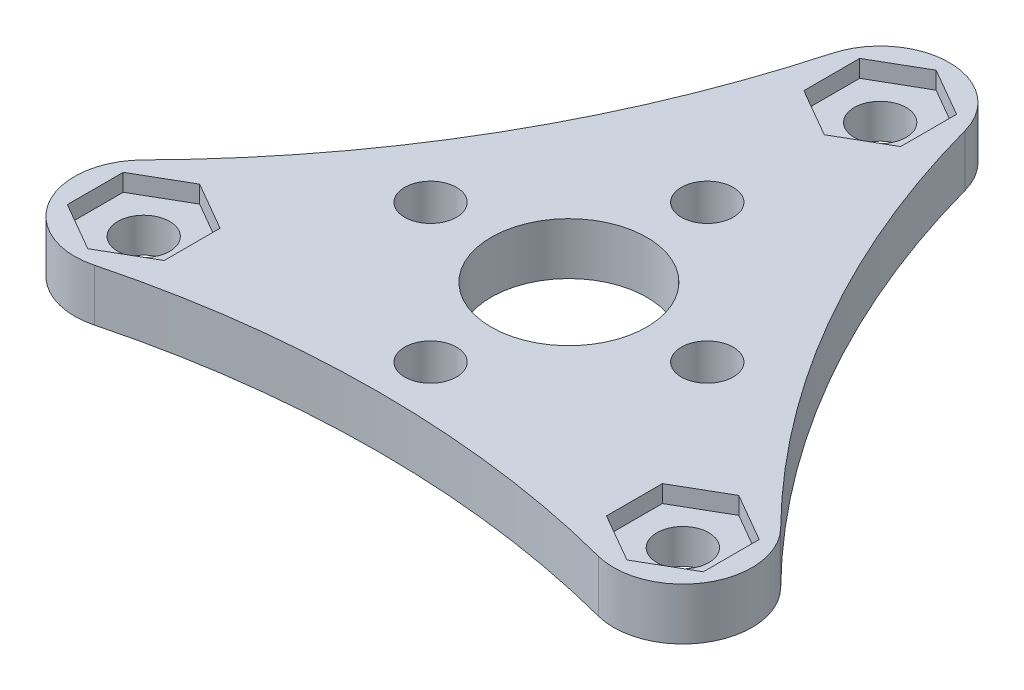
ISO-10303-21;
HEADER;
FILE_DESCRIPTION(('STEP AP214'),'2;1');
FILE_NAME('part.step','',(''),(''),'','','');
FILE_SCHEMA(('AUTOMOTIVE_DESIGN { 1 0 10303 214 1 1 1 1 }'));
ENDSEC;
DATA;
#1=APPLICATION_CONTEXT('core data for automotive mechanical design processes');
#2=APPLICATION_PROTOCOL_DEFINITION('international standard','automotive_design',2000,#1);
#3=PRODUCT_CONTEXT('',#1,'mechanical');
#4=PRODUCT('Part','Part','',(#3));
#5=PRODUCT_RELATED_PRODUCT_CATEGORY('part','',(#4));
#6=PRODUCT_DEFINITION_FORMATION('','',#4);
#7=PRODUCT_DEFINITION_CONTEXT('part definition',#1,'design');
#8=PRODUCT_DEFINITION('design','',#6,#7);
#9=PRODUCT_DEFINITION_SHAPE('','',#8);
#10=(LENGTH_UNIT() NAMED_UNIT(*) SI_UNIT(.MILLI.,.METRE.));
#11=(NAMED_UNIT(*) PLANE_ANGLE_UNIT() SI_UNIT($,.RADIAN.));
#12=(NAMED_UNIT(*) SI_UNIT($,.STERADIAN.) SOLID_ANGLE_UNIT());
#13=UNCERTAINTY_MEASURE_WITH_UNIT(LENGTH_MEASURE(1.E-05),#10,'distance_accuracy_value','');
#14=(GEOMETRIC_REPRESENTATION_CONTEXT(3) GLOBAL_UNCERTAINTY_ASSIGNED_CONTEXT((#13)) GLOBAL_UNIT_ASSIGNED_CONTEXT((#10,
#11,#12)) REPRESENTATION_CONTEXT('',''));
#15=CARTESIAN_POINT('',(0.,0.,0.));
#16=DIRECTION('',(0.,0.,1.));
#17=DIRECTION('',(1.,0.,0.));
#18=AXIS2_PLACEMENT_3D('',#15,#16,#17);
#19=CARTESIAN_POINT('',(1.52920183862257E-12,3.,-18.));
#20=DIRECTION('',(0.,-1.,0.));
#21=DIRECTION('',(0.,0.,-1.));
#22=AXIS2_PLACEMENT_3D('',#19,#20,#21);
#23=CYLINDRICAL_SURFACE('',#22,1.49999999999863);
#24=CARTESIAN_POINT('',(1.52920183862257E-12,0.,-18.));
#25=DIRECTION('',(0.,1.,0.));
#26=DIRECTION('',(0.,0.,1.));
#27=AXIS2_PLACEMENT_3D('',#24,#25,#26);
#28=CIRCLE('',#27,1.49999999999863);
#29=CARTESIAN_POINT('',(1.52920183862257E-12,0.,-16.5000000000014));
#30=VERTEX_POINT('',#29);
#31=EDGE_CURVE('E376',#30,#30,#28,.T.);
#32=ORIENTED_EDGE('',*,*,#31,.F.);
#33=EDGE_LOOP('',(#32));
#34=FACE_BOUND('',#33,.T.);
#35=CARTESIAN_POINT('',(1.52920183862257E-12,2.,-18.));
#36=DIRECTION('',(0.,1.,0.));
#37=DIRECTION('',(0.,0.,1.));
#38=AXIS2_PLACEMENT_3D('',#35,#36,#37);
#39=CIRCLE('',#38,1.49999999999863);
#40=CARTESIAN_POINT('',(1.52920183862257E-12,2.,-16.5000000000014));
#41=VERTEX_POINT('',#40);
#42=EDGE_CURVE('E40',#41,#41,#39,.T.);
#43=ORIENTED_EDGE('',*,*,#42,.T.);
#44=EDGE_LOOP('',(#43));
#45=FACE_BOUND('',#44,.T.);
#46=ADVANCED_FACE('F36',(#34,#45),#23,.F.);
#47=CARTESIAN_POINT('',(15.5884572681221,3.,9.00000000000045));
#48=DIRECTION('',(0.,-1.,0.));
#49=DIRECTION('',(0.,0.,-1.));
#50=AXIS2_PLACEMENT_3D('',#47,#48,#49);
#51=CYLINDRICAL_SURFACE('',#50,1.50000000000022);
#52=CARTESIAN_POINT('',(15.5884572681221,0.,9.00000000000045));
#53=DIRECTION('',(0.,1.,0.));
#54=DIRECTION('',(0.,0.,1.));
#55=AXIS2_PLACEMENT_3D('',#52,#53,#54);
#56=CIRCLE('',#55,1.50000000000022);
#57=CARTESIAN_POINT('',(15.5884572681221,0.,10.5000000000007));
#58=VERTEX_POINT('',#57);
#59=EDGE_CURVE('E357',#58,#58,#56,.T.);
#60=ORIENTED_EDGE('',*,*,#59,.F.);
#61=EDGE_LOOP('',(#60));
#62=FACE_BOUND('',#61,.T.);
#63=CARTESIAN_POINT('',(15.5884572681221,2.,9.00000000000045));
#64=DIRECTION('',(0.,1.,0.));
#65=DIRECTION('',(0.,0.,1.));
#66=AXIS2_PLACEMENT_3D('',#63,#64,#65);
#67=CIRCLE('',#66,1.50000000000022);
#68=CARTESIAN_POINT('',(15.5884572681221,2.,10.5000000000007));
#69=VERTEX_POINT('',#68);
#70=EDGE_CURVE('E428',#69,#69,#67,.T.);
#71=ORIENTED_EDGE('',*,*,#70,.T.);
#72=EDGE_LOOP('',(#71));
#73=FACE_BOUND('',#72,.T.);
#74=ADVANCED_FACE('F445',(#62,#73),#51,.F.);
#75=CARTESIAN_POINT('',(-15.5884572681184,3.,9.00000000000081));
#76=DIRECTION('',(0.,-1.,0.));
#77=DIRECTION('',(0.,0.,-1.));
#78=AXIS2_PLACEMENT_3D('',#75,#76,#77);
#79=CYLINDRICAL_SURFACE('',#78,1.50000000000188);
#80=CARTESIAN_POINT('',(-15.5884572681184,0.,9.00000000000081));
#81=DIRECTION('',(0.,1.,0.));
#82=DIRECTION('',(0.,0.,1.));
#83=AXIS2_PLACEMENT_3D('',#80,#81,#82);
#84=CIRCLE('',#83,1.50000000000188);
#85=CARTESIAN_POINT('',(-15.5884572681184,0.,10.5000000000027));
#86=VERTEX_POINT('',#85);
#87=EDGE_CURVE('E351',#86,#86,#84,.T.);
#88=ORIENTED_EDGE('',*,*,#87,.F.);
#89=EDGE_LOOP('',(#88));
#90=FACE_BOUND('',#89,.T.);
#91=CARTESIAN_POINT('',(-15.5884572681184,2.,9.00000000000081));
#92=DIRECTION('',(0.,1.,0.));
#93=DIRECTION('',(0.,0.,1.));
#94=AXIS2_PLACEMENT_3D('',#91,#92,#93);
#95=CIRCLE('',#94,1.50000000000188);
#96=CARTESIAN_POINT('',(-15.5884572681184,2.,10.5000000000027));
#97=VERTEX_POINT('',#96);
#98=EDGE_CURVE('E247',#97,#97,#95,.T.);
#99=ORIENTED_EDGE('',*,*,#98,.T.);
#100=EDGE_LOOP('',(#99));
#101=FACE_BOUND('',#100,.T.);
#102=ADVANCED_FACE('F451',(#90,#101),#79,.F.);
#103=CARTESIAN_POINT('',(-29.7496047149619,3.,-26.1759422904685));
#104=DIRECTION('',(0.,1.,0.));
#105=DIRECTION('',(0.,0.,1.));
#106=AXIS2_PLACEMENT_3D('',#103,#104,#105);
#107=PLANE('',#106);
#108=DIRECTION('',(0.866025403784439,0.,0.5));
#109=VECTOR('',#108,1.);
#110=CARTESIAN_POINT('',(-2.79999999999847,3.,-16.383419246269));
#111=LINE('',#110,#109);
#112=CARTESIAN_POINT('',(-2.79999999999847,3.,-16.383419246269));
#113=VERTEX_POINT('',#112);
#114=CARTESIAN_POINT('',(1.53002610581154E-12,3.,-14.7668384925381));
#115=VERTEX_POINT('',#114);
#116=EDGE_CURVE('E53',#113,#115,#111,.T.);
#117=ORIENTED_EDGE('',*,*,#116,.F.);
#118=DIRECTION('',(0.,0.,1.));
#119=VECTOR('',#118,1.);
#120=CARTESIAN_POINT('',(-2.79999999999847,3.,-19.6165807537309));
#121=LINE('',#120,#119);
#122=CARTESIAN_POINT('',(-2.79999999999847,3.,-19.6165807537309));
#123=VERTEX_POINT('',#122);
#124=EDGE_CURVE('E220',#123,#113,#121,.T.);
#125=ORIENTED_EDGE('',*,*,#124,.F.);
#126=DIRECTION('',(-0.866025403784439,0.,0.5));
#127=VECTOR('',#126,1.);
#128=CARTESIAN_POINT('',(1.53262851652121E-12,3.,-21.2331615074619));
#129=LINE('',#128,#127);
#130=CARTESIAN_POINT('',(1.53262851652121E-12,3.,-21.2331615074619));
#131=VERTEX_POINT('',#130);
#132=EDGE_CURVE('E223',#131,#123,#129,.T.);
#133=ORIENTED_EDGE('',*,*,#132,.F.);
#134=DIRECTION('',(-0.866025403784439,0.,-0.5));
#135=VECTOR('',#134,1.);
#136=CARTESIAN_POINT('',(2.80000000000153,3.,-19.6165807537309));
#137=LINE('',#136,#135);
#138=CARTESIAN_POINT('',(2.80000000000153,3.,-19.6165807537309));
#139=VERTEX_POINT('',#138);
#140=EDGE_CURVE('E240',#139,#131,#137,.T.);
#141=ORIENTED_EDGE('',*,*,#140,.F.);
#142=DIRECTION('',(0.,0.,-1.));
#143=VECTOR('',#142,1.);
#144=CARTESIAN_POINT('',(2.80000000000153,3.,-16.383419246269));
#145=LINE('',#144,#143);
#146=CARTESIAN_POINT('',(2.80000000000153,3.,-16.383419246269));
#147=VERTEX_POINT('',#146);
#148=EDGE_CURVE('E237',#147,#139,#145,.T.);
#149=ORIENTED_EDGE('',*,*,#148,.F.);
#150=DIRECTION('',(0.866025403784439,0.,-0.5));
#151=VECTOR('',#150,1.);
#152=CARTESIAN_POINT('',(1.52915761052985E-12,3.,-14.7668384925381));
#153=LINE('',#152,#151);
#154=EDGE_CURVE('E234',#115,#147,#153,.T.);
#155=ORIENTED_EDGE('',*,*,#154,.F.);
#156=EDGE_LOOP('',(#117,#125,#133,#141,#149,#155));
#157=FACE_BOUND('',#156,.T.);
#158=DIRECTION('',(-0.866025403784439,0.,0.5));
#159=VECTOR('',#158,1.);
#160=CARTESIAN_POINT('',(15.5884572681201,3.,5.76683849253888));
#161=LINE('',#160,#159);
#162=CARTESIAN_POINT('',(15.5884572681201,3.,5.76683849253888));
#163=VERTEX_POINT('',#162);
#164=CARTESIAN_POINT('',(12.7884572681201,3.,7.38341924626983));
#165=VERTEX_POINT('',#164);
#166=EDGE_CURVE('E61',#163,#165,#161,.T.);
#167=ORIENTED_EDGE('',*,*,#166,.F.);
#168=DIRECTION('',(-0.866025403784439,0.,-0.5));
#169=VECTOR('',#168,1.);
#170=CARTESIAN_POINT('',(18.3884572681201,3.,7.38341924626983));
#171=LINE('',#170,#169);
#172=CARTESIAN_POINT('',(18.3884572681201,3.,7.38341924626983));
#173=VERTEX_POINT('',#172);
#174=EDGE_CURVE('E259',#173,#163,#171,.T.);
#175=ORIENTED_EDGE('',*,*,#174,.F.);
#176=DIRECTION('',(0.,0.,-1.));
#177=VECTOR('',#176,1.);
#178=CARTESIAN_POINT('',(18.3884572681201,3.,10.6165807537317));
#179=LINE('',#178,#177);
#180=CARTESIAN_POINT('',(18.3884572681201,3.,10.6165807537317));
#181=VERTEX_POINT('',#180);
#182=EDGE_CURVE('E286',#181,#173,#179,.T.);
#183=ORIENTED_EDGE('',*,*,#182,.F.);
#184=DIRECTION('',(0.866025403784438,0.,-0.5));
#185=VECTOR('',#184,1.);
#186=CARTESIAN_POINT('',(15.5884572681201,3.,12.2331615074627));
#187=LINE('',#186,#185);
#188=CARTESIAN_POINT('',(15.5884572681201,3.,12.2331615074627));
#189=VERTEX_POINT('',#188);
#190=EDGE_CURVE('E283',#189,#181,#187,.T.);
#191=ORIENTED_EDGE('',*,*,#190,.F.);
#192=DIRECTION('',(0.866025403784439,0.,0.5));
#193=VECTOR('',#192,1.);
#194=CARTESIAN_POINT('',(12.7884572681201,3.,10.6165807537317));
#195=LINE('',#194,#193);
#196=CARTESIAN_POINT('',(12.7884572681201,3.,10.6165807537317));
#197=VERTEX_POINT('',#196);
#198=EDGE_CURVE('E280',#197,#189,#195,.T.);
#199=ORIENTED_EDGE('',*,*,#198,.F.);
#200=DIRECTION('',(0.,0.,1.));
#201=VECTOR('',#200,1.);
#202=CARTESIAN_POINT('',(12.7884572681201,3.,7.38341924626983));
#203=LINE('',#202,#201);
#204=EDGE_CURVE('E276',#165,#197,#203,.T.);
#205=ORIENTED_EDGE('',*,*,#204,.F.);
#206=EDGE_LOOP('',(#167,#175,#183,#191,#199,#205));
#207=FACE_BOUND('',#206,.T.);
#208=DIRECTION('',(0.,0.,-1.));
#209=VECTOR('',#208,1.);
#210=CARTESIAN_POINT('',(-12.7884572681197,3.,10.6165807537302));
#211=LINE('',#210,#209);
#212=CARTESIAN_POINT('',(-12.7884572681197,3.,10.6165807537302));
#213=VERTEX_POINT('',#212);
#214=CARTESIAN_POINT('',(-12.7884572681197,3.,7.38341924626827));
#215=VERTEX_POINT('',#214);
#216=EDGE_CURVE('E321',#213,#215,#211,.T.);
#217=ORIENTED_EDGE('',*,*,#216,.F.);
#218=DIRECTION('',(0.866025403784438,0.,-0.5));
#219=VECTOR('',#218,1.);
#220=CARTESIAN_POINT('',(-15.5884572681197,3.,12.2331615074611));
#221=LINE('',#220,#219);
#222=CARTESIAN_POINT('',(-15.5884572681197,3.,12.2331615074611));
#223=VERTEX_POINT('',#222);
#224=EDGE_CURVE('E305',#223,#213,#221,.T.);
#225=ORIENTED_EDGE('',*,*,#224,.F.);
#226=DIRECTION('',(0.866025403784439,0.,0.499999999999999));
#227=VECTOR('',#226,1.);
#228=CARTESIAN_POINT('',(-18.3884572681197,3.,10.6165807537302));
#229=LINE('',#228,#227);
#230=CARTESIAN_POINT('',(-18.3884572681197,3.,10.6165807537302));
#231=VERTEX_POINT('',#230);
#232=EDGE_CURVE('E332',#231,#223,#229,.T.);
#233=ORIENTED_EDGE('',*,*,#232,.F.);
#234=DIRECTION('',(0.,0.,1.));
#235=VECTOR('',#234,1.);
#236=CARTESIAN_POINT('',(-18.3884572681197,3.,7.38341924626827));
#237=LINE('',#236,#235);
#238=CARTESIAN_POINT('',(-18.3884572681197,3.,7.38341924626827));
#239=VERTEX_POINT('',#238);
#240=EDGE_CURVE('E329',#239,#231,#237,.T.);
#241=ORIENTED_EDGE('',*,*,#240,.F.);
#242=DIRECTION('',(-0.866025403784438,0.,0.5));
#243=VECTOR('',#242,1.);
#244=CARTESIAN_POINT('',(-15.5884572681197,3.,5.76683849253731));
#245=LINE('',#244,#243);
#246=CARTESIAN_POINT('',(-15.5884572681197,3.,5.76683849253731));
#247=VERTEX_POINT('',#246);
#248=EDGE_CURVE('E326',#247,#239,#245,.T.);
#249=ORIENTED_EDGE('',*,*,#248,.F.);
#250=DIRECTION('',(-0.866025403784439,0.,-0.5));
#251=VECTOR('',#250,1.);
#252=CARTESIAN_POINT('',(-12.7884572681197,3.,7.38341924626827));
#253=LINE('',#252,#251);
#254=EDGE_CURVE('E323',#215,#247,#253,.T.);
#255=ORIENTED_EDGE('',*,*,#254,.F.);
#256=EDGE_LOOP('',(#217,#225,#233,#241,#249,#255));
#257=FACE_BOUND('',#256,.T.);
#258=CARTESIAN_POINT('',(0.,3.,-8.));
#259=DIRECTION('',(0.,1.,0.));
#260=DIRECTION('',(0.,0.,1.));
#261=AXIS2_PLACEMENT_3D('',#258,#259,#260);
#262=CIRCLE('',#261,1.5);
#263=CARTESIAN_POINT('',(0.,3.,-6.5));
#264=VERTEX_POINT('',#263);
#265=EDGE_CURVE('E361',#264,#264,#262,.T.);
#266=ORIENTED_EDGE('',*,*,#265,.F.);
#267=EDGE_LOOP('',(#266));
#268=FACE_BOUND('',#267,.T.);
#269=CARTESIAN_POINT('',(0.,3.,8.));
#270=DIRECTION('',(0.,1.,0.));
#271=DIRECTION('',(0.,0.,1.));
#272=AXIS2_PLACEMENT_3D('',#269,#270,#271);
#273=CIRCLE('',#272,1.5);
#274=CARTESIAN_POINT('',(0.,3.,9.5));
#275=VERTEX_POINT('',#274);
#276=EDGE_CURVE('E373',#275,#275,#273,.T.);
#277=ORIENTED_EDGE('',*,*,#276,.F.);
#278=EDGE_LOOP('',(#277));
#279=FACE_BOUND('',#278,.T.);
#280=CARTESIAN_POINT('',(8.,3.,0.));
#281=DIRECTION('',(0.,1.,0.));
#282=DIRECTION('',(0.,0.,1.));
#283=AXIS2_PLACEMENT_3D('',#280,#281,#282);
#284=CIRCLE('',#283,1.5);
#285=CARTESIAN_POINT('',(8.,3.,1.5));
#286=VERTEX_POINT('',#285);
#287=EDGE_CURVE('E382',#286,#286,#284,.T.);
#288=ORIENTED_EDGE('',*,*,#287,.F.);
#289=EDGE_LOOP('',(#288));
#290=FACE_BOUND('',#289,.T.);
#291=CARTESIAN_POINT('',(-59.4992094299253,3.,-34.351884580937));
#292=DIRECTION('',(0.,-1.,0.));
#293=DIRECTION('',(0.,0.,1.));
#294=AXIS2_PLACEMENT_3D('',#291,#292,#293);
#295=CIRCLE('',#294,57.7052676206382);
#296=CARTESIAN_POINT('',(-3.85699384990613,3.,-19.0599992649877));
#297=VERTEX_POINT('',#296);
#298=CARTESIAN_POINT('',(-18.4349404845424,3.,6.18974497623219));
#299=VERTEX_POINT('',#298);
#300=EDGE_CURVE('E388',#297,#299,#295,.T.);
#301=ORIENTED_EDGE('',*,*,#300,.T.);
#302=CARTESIAN_POINT('',(-15.5884572681184,3.,9.00000000000081));
#303=DIRECTION('',(0.,1.,0.));
#304=DIRECTION('',(0.,0.,1.));
#305=AXIS2_PLACEMENT_3D('',#302,#303,#304);
#306=CIRCLE('',#305,4.00000000000001);
#307=CARTESIAN_POINT('',(-14.5779466346368,3.,12.8702542887551));
#308=VERTEX_POINT('',#307);
#309=EDGE_CURVE('E391',#299,#308,#306,.T.);
#310=ORIENTED_EDGE('',*,*,#309,.T.);
#311=CARTESIAN_POINT('',(2.54741645301558E-12,3.,68.7037691618766));
#312=DIRECTION('',(0.,-1.,0.));
#313=DIRECTION('',(0.,0.,1.));
#314=AXIS2_PLACEMENT_3D('',#311,#312,#313);
#315=CIRCLE('',#314,57.7052676206382);
#316=CARTESIAN_POINT('',(14.5779466346376,3.,12.8702542887539));
#317=VERTEX_POINT('',#316);
#318=EDGE_CURVE('E394',#308,#317,#315,.T.);
#319=ORIENTED_EDGE('',*,*,#318,.T.);
#320=CARTESIAN_POINT('',(15.5884572681221,3.,9.00000000000045));
#321=DIRECTION('',(0.,1.,0.));
#322=DIRECTION('',(0.,0.,1.));
#323=AXIS2_PLACEMENT_3D('',#320,#321,#322);
#324=CIRCLE('',#323,4.);
#325=CARTESIAN_POINT('',(18.4349404845481,3.,6.18974497623392));
#326=VERTEX_POINT('',#325);
#327=EDGE_CURVE('E396',#317,#326,#324,.T.);
#328=ORIENTED_EDGE('',*,*,#327,.T.);
#329=CARTESIAN_POINT('',(59.499209429928,3.,-34.3518845809384));
#330=DIRECTION('',(0.,-1.,0.));
#331=DIRECTION('',(0.,0.,1.));
#332=AXIS2_PLACEMENT_3D('',#329,#330,#331);
#333=CIRCLE('',#332,57.7052676206382);
#334=CARTESIAN_POINT('',(3.85699384990997,3.,-19.0599992649849));
#335=VERTEX_POINT('',#334);
#336=EDGE_CURVE('E398',#326,#335,#333,.T.);
#337=ORIENTED_EDGE('',*,*,#336,.T.);
#338=CARTESIAN_POINT('',(1.52920183862257E-12,3.,-18.));
#339=DIRECTION('',(0.,1.,0.));
#340=DIRECTION('',(0.,0.,1.));
#341=AXIS2_PLACEMENT_3D('',#338,#339,#340);
#342=CIRCLE('',#341,4.);
#343=EDGE_CURVE('E400',#335,#297,#342,.T.);
#344=ORIENTED_EDGE('',*,*,#343,.T.);
#345=EDGE_LOOP('',(#301,#310,#319,#328,#337,#344));
#346=FACE_BOUND('',#345,.T.);
#347=CARTESIAN_POINT('',(-8.,3.,0.));
#348=DIRECTION('',(0.,1.,0.));
#349=DIRECTION('',(0.,0.,1.));
#350=AXIS2_PLACEMENT_3D('',#347,#348,#349);
#351=CIRCLE('',#350,1.5);
#352=CARTESIAN_POINT('',(-8.,3.,1.49999999999994));
#353=VERTEX_POINT('',#352);
#354=EDGE_CURVE('E367',#353,#353,#351,.T.);
#355=ORIENTED_EDGE('',*,*,#354,.F.);
#356=EDGE_LOOP('',(#355));
#357=FACE_BOUND('',#356,.T.);
#358=CARTESIAN_POINT('',(0.,3.,0.));
#359=DIRECTION('',(0.,1.,0.));
#360=DIRECTION('',(0.,0.,1.));
#361=AXIS2_PLACEMENT_3D('',#358,#359,#360);
#362=CIRCLE('',#361,4.5);
#363=CARTESIAN_POINT('',(0.,3.,4.5));
#364=VERTEX_POINT('',#363);
#365=EDGE_CURVE('E348',#364,#364,#362,.T.);
#366=ORIENTED_EDGE('',*,*,#365,.F.);
#367=EDGE_LOOP('',(#366));
#368=FACE_BOUND('',#367,.T.);
#369=ADVANCED_FACE('F464',(#157,#207,#257,#268,#279,#290,#346,#357,#368),#107,.T.);
#370=CARTESIAN_POINT('',(-29.7496047149619,0.,-26.1759422904685));
#371=DIRECTION('',(0.,1.,0.));
#372=DIRECTION('',(0.,0.,1.));
#373=AXIS2_PLACEMENT_3D('',#370,#371,#372);
#374=PLANE('',#373);
#375=CARTESIAN_POINT('',(-59.4992094299253,0.,-34.351884580937));
#376=DIRECTION('',(0.,-1.,0.));
#377=DIRECTION('',(0.,0.,1.));
#378=AXIS2_PLACEMENT_3D('',#375,#376,#377);
#379=CIRCLE('',#378,57.7052676206382);
#380=CARTESIAN_POINT('',(-3.85699384990613,0.,-19.0599992649877));
#381=VERTEX_POINT('',#380);
#382=CARTESIAN_POINT('',(-18.4349404845424,0.,6.18974497623219));
#383=VERTEX_POINT('',#382);
#384=EDGE_CURVE('E385',#381,#383,#379,.T.);
#385=ORIENTED_EDGE('',*,*,#384,.F.);
#386=CARTESIAN_POINT('',(1.52920183862257E-12,0.,-18.));
#387=DIRECTION('',(0.,1.,0.));
#388=DIRECTION('',(0.,0.,1.));
#389=AXIS2_PLACEMENT_3D('',#386,#387,#388);
#390=CIRCLE('',#389,4.);
#391=CARTESIAN_POINT('',(3.85699384990997,0.,-19.0599992649849));
#392=VERTEX_POINT('',#391);
#393=EDGE_CURVE('E392',#392,#381,#390,.T.);
#394=ORIENTED_EDGE('',*,*,#393,.F.);
#395=CARTESIAN_POINT('',(59.499209429928,0.,-34.3518845809384));
#396=DIRECTION('',(0.,-1.,0.));
#397=DIRECTION('',(0.,0.,1.));
#398=AXIS2_PLACEMENT_3D('',#395,#396,#397);
#399=CIRCLE('',#398,57.7052676206382);
#400=CARTESIAN_POINT('',(18.4349404845481,0.,6.18974497623392));
#401=VERTEX_POINT('',#400);
#402=EDGE_CURVE('E411',#401,#392,#399,.T.);
#403=ORIENTED_EDGE('',*,*,#402,.F.);
#404=CARTESIAN_POINT('',(15.5884572681221,0.,9.00000000000045));
#405=DIRECTION('',(0.,1.,0.));
#406=DIRECTION('',(0.,0.,1.));
#407=AXIS2_PLACEMENT_3D('',#404,#405,#406);
#408=CIRCLE('',#407,4.);
#409=CARTESIAN_POINT('',(14.5779466346376,0.,12.8702542887539));
#410=VERTEX_POINT('',#409);
#411=EDGE_CURVE('E409',#410,#401,#408,.T.);
#412=ORIENTED_EDGE('',*,*,#411,.F.);
#413=CARTESIAN_POINT('',(2.54741645301558E-12,0.,68.7037691618766));
#414=DIRECTION('',(0.,-1.,0.));
#415=DIRECTION('',(0.,0.,1.));
#416=AXIS2_PLACEMENT_3D('',#413,#414,#415);
#417=CIRCLE('',#416,57.7052676206382);
#418=CARTESIAN_POINT('',(-14.5779466346368,0.,12.8702542887551));
#419=VERTEX_POINT('',#418);
#420=EDGE_CURVE('E407',#419,#410,#417,.T.);
#421=ORIENTED_EDGE('',*,*,#420,.F.);
#422=CARTESIAN_POINT('',(-15.5884572681184,0.,9.00000000000081));
#423=DIRECTION('',(0.,1.,0.));
#424=DIRECTION('',(0.,0.,1.));
#425=AXIS2_PLACEMENT_3D('',#422,#423,#424);
#426=CIRCLE('',#425,4.00000000000001);
#427=EDGE_CURVE('E405',#383,#419,#426,.T.);
#428=ORIENTED_EDGE('',*,*,#427,.F.);
#429=EDGE_LOOP('',(#385,#394,#403,#412,#421,#428));
#430=FACE_BOUND('',#429,.T.);
#431=CARTESIAN_POINT('',(8.,0.,0.));
#432=DIRECTION('',(0.,1.,0.));
#433=DIRECTION('',(0.,0.,1.));
#434=AXIS2_PLACEMENT_3D('',#431,#432,#433);
#435=CIRCLE('',#434,1.5);
#436=CARTESIAN_POINT('',(8.,0.,1.5));
#437=VERTEX_POINT('',#436);
#438=EDGE_CURVE('E381',#437,#437,#435,.T.);
#439=ORIENTED_EDGE('',*,*,#438,.T.);
#440=EDGE_LOOP('',(#439));
#441=FACE_BOUND('',#440,.T.);
#442=ORIENTED_EDGE('',*,*,#31,.T.);
#443=EDGE_LOOP('',(#442));
#444=FACE_BOUND('',#443,.T.);
#445=CARTESIAN_POINT('',(0.,0.,8.));
#446=DIRECTION('',(0.,1.,0.));
#447=DIRECTION('',(0.,0.,1.));
#448=AXIS2_PLACEMENT_3D('',#445,#446,#447);
#449=CIRCLE('',#448,1.5);
#450=CARTESIAN_POINT('',(0.,0.,9.5));
#451=VERTEX_POINT('',#450);
#452=EDGE_CURVE('E370',#451,#451,#449,.T.);
#453=ORIENTED_EDGE('',*,*,#452,.T.);
#454=EDGE_LOOP('',(#453));
#455=FACE_BOUND('',#454,.T.);
#456=CARTESIAN_POINT('',(-8.,0.,0.));
#457=DIRECTION('',(0.,1.,0.));
#458=DIRECTION('',(0.,0.,1.));
#459=AXIS2_PLACEMENT_3D('',#456,#457,#458);
#460=CIRCLE('',#459,1.5);
#461=CARTESIAN_POINT('',(-8.,0.,1.49999999999994));
#462=VERTEX_POINT('',#461);
#463=EDGE_CURVE('E364',#462,#462,#460,.T.);
#464=ORIENTED_EDGE('',*,*,#463,.T.);
#465=EDGE_LOOP('',(#464));
#466=FACE_BOUND('',#465,.T.);
#467=CARTESIAN_POINT('',(0.,0.,-8.));
#468=DIRECTION('',(0.,1.,0.));
#469=DIRECTION('',(0.,0.,1.));
#470=AXIS2_PLACEMENT_3D('',#467,#468,#469);
#471=CIRCLE('',#470,1.5);
#472=CARTESIAN_POINT('',(0.,0.,-6.5));
#473=VERTEX_POINT('',#472);
#474=EDGE_CURVE('E360',#473,#473,#471,.T.);
#475=ORIENTED_EDGE('',*,*,#474,.T.);
#476=EDGE_LOOP('',(#475));
#477=FACE_BOUND('',#476,.T.);
#478=ORIENTED_EDGE('',*,*,#59,.T.);
#479=EDGE_LOOP('',(#478));
#480=FACE_BOUND('',#479,.T.);
#481=ORIENTED_EDGE('',*,*,#87,.T.);
#482=EDGE_LOOP('',(#481));
#483=FACE_BOUND('',#482,.T.);
#484=CARTESIAN_POINT('',(0.,0.,0.));
#485=DIRECTION('',(0.,1.,0.));
#486=DIRECTION('',(0.,0.,1.));
#487=AXIS2_PLACEMENT_3D('',#484,#485,#486);
#488=CIRCLE('',#487,4.5);
#489=CARTESIAN_POINT('',(0.,0.,4.5));
#490=VERTEX_POINT('',#489);
#491=EDGE_CURVE('E352',#490,#490,#488,.T.);
#492=ORIENTED_EDGE('',*,*,#491,.T.);
#493=EDGE_LOOP('',(#492));
#494=FACE_BOUND('',#493,.T.);
#495=ADVANCED_FACE('F467',(#430,#441,#444,#455,#466,#477,#480,#483,#494),#374,.F.);
#496=CARTESIAN_POINT('',(-59.4992094299253,3.,-34.351884580937));
#497=DIRECTION('',(0.,-1.,0.));
#498=DIRECTION('',(0.,0.,-1.));
#499=AXIS2_PLACEMENT_3D('',#496,#497,#498);
#500=CYLINDRICAL_SURFACE('',#499,57.7052676206382);
#501=ORIENTED_EDGE('',*,*,#384,.T.);
#502=DIRECTION('',(0.,-1.,0.));
#503=VECTOR('',#502,1.);
#504=CARTESIAN_POINT('',(-18.4349404845424,3.,6.18974497623219));
#505=LINE('',#504,#503);
#506=EDGE_CURVE('E11',#299,#383,#505,.T.);
#507=ORIENTED_EDGE('',*,*,#506,.F.);
#508=ORIENTED_EDGE('',*,*,#300,.F.);
#509=DIRECTION('',(0.,-1.,0.));
#510=VECTOR('',#509,1.);
#511=CARTESIAN_POINT('',(-3.85699384990613,3.,-19.0599992649877));
#512=LINE('',#511,#510);
#513=EDGE_CURVE('E402',#297,#381,#512,.T.);
#514=ORIENTED_EDGE('',*,*,#513,.T.);
#515=EDGE_LOOP('',(#501,#507,#508,#514));
#516=FACE_BOUND('',#515,.T.);
#517=ADVANCED_FACE('F38',(#516),#500,.F.);
#518=CARTESIAN_POINT('',(-15.5884572681184,3.,9.00000000000081));
#519=DIRECTION('',(0.,-1.,0.));
#520=DIRECTION('',(0.,0.,-1.));
#521=AXIS2_PLACEMENT_3D('',#518,#519,#520);
#522=CYLINDRICAL_SURFACE('',#521,4.00000000000001);
#523=ORIENTED_EDGE('',*,*,#427,.T.);
#524=DIRECTION('',(0.,-1.,0.));
#525=VECTOR('',#524,1.);
#526=CARTESIAN_POINT('',(-14.5779466346368,3.,12.8702542887551));
#527=LINE('',#526,#525);
#528=EDGE_CURVE('E45',#308,#419,#527,.T.);
#529=ORIENTED_EDGE('',*,*,#528,.F.);
#530=ORIENTED_EDGE('',*,*,#309,.F.);
#531=ORIENTED_EDGE('',*,*,#506,.T.);
#532=EDGE_LOOP('',(#523,#529,#530,#531));
#533=FACE_BOUND('',#532,.T.);
#534=ADVANCED_FACE('F485',(#533),#522,.T.);
#535=CARTESIAN_POINT('',(2.54741645301558E-12,3.,68.7037691618766));
#536=DIRECTION('',(0.,-1.,0.));
#537=DIRECTION('',(0.,0.,-1.));
#538=AXIS2_PLACEMENT_3D('',#535,#536,#537);
#539=CYLINDRICAL_SURFACE('',#538,57.7052676206382);
#540=ORIENTED_EDGE('',*,*,#420,.T.);
#541=DIRECTION('',(0.,-1.,0.));
#542=VECTOR('',#541,1.);
#543=CARTESIAN_POINT('',(14.5779466346376,3.,12.8702542887539));
#544=LINE('',#543,#542);
#545=EDGE_CURVE('E422',#317,#410,#544,.T.);
#546=ORIENTED_EDGE('',*,*,#545,.F.);
#547=ORIENTED_EDGE('',*,*,#318,.F.);
#548=ORIENTED_EDGE('',*,*,#528,.T.);
#549=EDGE_LOOP('',(#540,#546,#547,#548));
#550=FACE_BOUND('',#549,.T.);
#551=ADVANCED_FACE('F482',(#550),#539,.F.);
#552=CARTESIAN_POINT('',(15.5884572681221,3.,9.00000000000045));
#553=DIRECTION('',(0.,-1.,0.));
#554=DIRECTION('',(0.,0.,-1.));
#555=AXIS2_PLACEMENT_3D('',#552,#553,#554);
#556=CYLINDRICAL_SURFACE('',#555,4.);
#557=ORIENTED_EDGE('',*,*,#411,.T.);
#558=DIRECTION('',(0.,-1.,0.));
#559=VECTOR('',#558,1.);
#560=CARTESIAN_POINT('',(18.4349404845481,3.,6.18974497623392));
#561=LINE('',#560,#559);
#562=EDGE_CURVE('E419',#326,#401,#561,.T.);
#563=ORIENTED_EDGE('',*,*,#562,.F.);
#564=ORIENTED_EDGE('',*,*,#327,.F.);
#565=ORIENTED_EDGE('',*,*,#545,.T.);
#566=EDGE_LOOP('',(#557,#563,#564,#565));
#567=FACE_BOUND('',#566,.T.);
#568=ADVANCED_FACE('F478',(#567),#556,.T.);
#569=CARTESIAN_POINT('',(59.499209429928,3.,-34.3518845809384));
#570=DIRECTION('',(0.,-1.,0.));
#571=DIRECTION('',(0.,0.,-1.));
#572=AXIS2_PLACEMENT_3D('',#569,#570,#571);
#573=CYLINDRICAL_SURFACE('',#572,57.7052676206382);
#574=ORIENTED_EDGE('',*,*,#402,.T.);
#575=DIRECTION('',(0.,-1.,0.));
#576=VECTOR('',#575,1.);
#577=CARTESIAN_POINT('',(3.85699384990997,3.,-19.0599992649849));
#578=LINE('',#577,#576);
#579=EDGE_CURVE('E416',#335,#392,#578,.T.);
#580=ORIENTED_EDGE('',*,*,#579,.F.);
#581=ORIENTED_EDGE('',*,*,#336,.F.);
#582=ORIENTED_EDGE('',*,*,#562,.T.);
#583=EDGE_LOOP('',(#574,#580,#581,#582));
#584=FACE_BOUND('',#583,.T.);
#585=ADVANCED_FACE('F474',(#584),#573,.F.);
#586=CARTESIAN_POINT('',(1.52920183862257E-12,3.,-18.));
#587=DIRECTION('',(0.,-1.,0.));
#588=DIRECTION('',(0.,0.,-1.));
#589=AXIS2_PLACEMENT_3D('',#586,#587,#588);
#590=CYLINDRICAL_SURFACE('',#589,4.);
#591=ORIENTED_EDGE('',*,*,#393,.T.);
#592=ORIENTED_EDGE('',*,*,#513,.F.);
#593=ORIENTED_EDGE('',*,*,#343,.F.);
#594=ORIENTED_EDGE('',*,*,#579,.T.);
#595=EDGE_LOOP('',(#591,#592,#593,#594));
#596=FACE_BOUND('',#595,.T.);
#597=ADVANCED_FACE('F462',(#596),#590,.T.);
#598=CARTESIAN_POINT('',(8.,3.,0.));
#599=DIRECTION('',(0.,-1.,0.));
#600=DIRECTION('',(0.,0.,-1.));
#601=AXIS2_PLACEMENT_3D('',#598,#599,#600);
#602=CYLINDRICAL_SURFACE('',#601,1.5);
#603=ORIENTED_EDGE('',*,*,#287,.T.);
#604=EDGE_LOOP('',(#603));
#605=FACE_BOUND('',#604,.T.);
#606=ORIENTED_EDGE('',*,*,#438,.F.);
#607=EDGE_LOOP('',(#606));
#608=FACE_BOUND('',#607,.T.);
#609=ADVANCED_FACE('F459',(#605,#608),#602,.F.);
#610=CARTESIAN_POINT('',(0.,3.,8.));
#611=DIRECTION('',(0.,-1.,0.));
#612=DIRECTION('',(0.,0.,-1.));
#613=AXIS2_PLACEMENT_3D('',#610,#611,#612);
#614=CYLINDRICAL_SURFACE('',#613,1.5);
#615=ORIENTED_EDGE('',*,*,#276,.T.);
#616=EDGE_LOOP('',(#615));
#617=FACE_BOUND('',#616,.T.);
#618=ORIENTED_EDGE('',*,*,#452,.F.);
#619=EDGE_LOOP('',(#618));
#620=FACE_BOUND('',#619,.T.);
#621=ADVANCED_FACE('F457',(#617,#620),#614,.F.);
#622=CARTESIAN_POINT('',(-8.,3.,0.));
#623=DIRECTION('',(0.,-1.,0.));
#624=DIRECTION('',(0.,0.,-1.));
#625=AXIS2_PLACEMENT_3D('',#622,#623,#624);
#626=CYLINDRICAL_SURFACE('',#625,1.5);
#627=ORIENTED_EDGE('',*,*,#354,.T.);
#628=EDGE_LOOP('',(#627));
#629=FACE_BOUND('',#628,.T.);
#630=ORIENTED_EDGE('',*,*,#463,.F.);
#631=EDGE_LOOP('',(#630));
#632=FACE_BOUND('',#631,.T.);
#633=ADVANCED_FACE('F531',(#629,#632),#626,.F.);
#634=CARTESIAN_POINT('',(0.,3.,-8.));
#635=DIRECTION('',(0.,-1.,0.));
#636=DIRECTION('',(0.,0.,-1.));
#637=AXIS2_PLACEMENT_3D('',#634,#635,#636);
#638=CYLINDRICAL_SURFACE('',#637,1.5);
#639=ORIENTED_EDGE('',*,*,#265,.T.);
#640=EDGE_LOOP('',(#639));
#641=FACE_BOUND('',#640,.T.);
#642=ORIENTED_EDGE('',*,*,#474,.F.);
#643=EDGE_LOOP('',(#642));
#644=FACE_BOUND('',#643,.T.);
#645=ADVANCED_FACE('F520',(#641,#644),#638,.F.);
#646=CARTESIAN_POINT('',(0.,3.,0.));
#647=DIRECTION('',(0.,-1.,0.));
#648=DIRECTION('',(0.,0.,-1.));
#649=AXIS2_PLACEMENT_3D('',#646,#647,#648);
#650=CYLINDRICAL_SURFACE('',#649,4.5);
#651=ORIENTED_EDGE('',*,*,#365,.T.);
#652=EDGE_LOOP('',(#651));
#653=FACE_BOUND('',#652,.T.);
#654=ORIENTED_EDGE('',*,*,#491,.F.);
#655=EDGE_LOOP('',(#654));
#656=FACE_BOUND('',#655,.T.);
#657=ADVANCED_FACE('F516',(#653,#656),#650,.F.);
#658=CARTESIAN_POINT('',(-12.7884572681197,2.,10.6165807537302));
#659=DIRECTION('',(1.,0.,0.));
#660=DIRECTION('',(0.,0.,-1.));
#661=AXIS2_PLACEMENT_3D('',#658,#659,#660);
#662=PLANE('',#661);
#663=ORIENTED_EDGE('',*,*,#216,.T.);
#664=DIRECTION('',(0.,1.,0.));
#665=VECTOR('',#664,1.);
#666=CARTESIAN_POINT('',(-12.7884572681197,2.,7.38341924626827));
#667=LINE('',#666,#665);
#668=CARTESIAN_POINT('',(-12.7884572681197,2.,7.38341924626827));
#669=VERTEX_POINT('',#668);
#670=EDGE_CURVE('E320',#669,#215,#667,.T.);
#671=ORIENTED_EDGE('',*,*,#670,.F.);
#672=DIRECTION('',(0.,0.,-1.));
#673=VECTOR('',#672,1.);
#674=CARTESIAN_POINT('',(-12.7884572681197,2.,10.6165807537302));
#675=LINE('',#674,#673);
#676=CARTESIAN_POINT('',(-12.7884572681197,2.,10.6165807537302));
#677=VERTEX_POINT('',#676);
#678=EDGE_CURVE('E301',#677,#669,#675,.T.);
#679=ORIENTED_EDGE('',*,*,#678,.F.);
#680=DIRECTION('',(0.,1.,0.));
#681=VECTOR('',#680,1.);
#682=CARTESIAN_POINT('',(-12.7884572681197,2.,10.6165807537302));
#683=LINE('',#682,#681);
#684=EDGE_CURVE('E277',#677,#213,#683,.T.);
#685=ORIENTED_EDGE('',*,*,#684,.T.);
#686=EDGE_LOOP('',(#663,#671,#679,#685));
#687=FACE_BOUND('',#686,.T.);
#688=ADVANCED_FACE('F519',(#687),#662,.F.);
#689=CARTESIAN_POINT('',(-15.5884572681197,2.,12.2331615074611));
#690=DIRECTION('',(0.5,0.,0.866025403784439));
#691=DIRECTION('',(0.866025403784438,0.,-0.5));
#692=AXIS2_PLACEMENT_3D('',#689,#690,#691);
#693=PLANE('',#692);
#694=ORIENTED_EDGE('',*,*,#224,.T.);
#695=ORIENTED_EDGE('',*,*,#684,.F.);
#696=DIRECTION('',(0.866025403784438,0.,-0.5));
#697=VECTOR('',#696,1.);
#698=CARTESIAN_POINT('',(-15.5884572681197,2.,12.2331615074611));
#699=LINE('',#698,#697);
#700=CARTESIAN_POINT('',(-15.5884572681197,2.,12.2331615074611));
#701=VERTEX_POINT('',#700);
#702=EDGE_CURVE('E317',#701,#677,#699,.T.);
#703=ORIENTED_EDGE('',*,*,#702,.F.);
#704=DIRECTION('',(0.,1.,0.));
#705=VECTOR('',#704,1.);
#706=CARTESIAN_POINT('',(-15.5884572681197,2.,12.2331615074611));
#707=LINE('',#706,#705);
#708=EDGE_CURVE('E338',#701,#223,#707,.T.);
#709=ORIENTED_EDGE('',*,*,#708,.T.);
#710=EDGE_LOOP('',(#694,#695,#703,#709));
#711=FACE_BOUND('',#710,.T.);
#712=ADVANCED_FACE('F528',(#711),#693,.F.);
#713=CARTESIAN_POINT('',(-18.3884572681197,2.,10.6165807537302));
#714=DIRECTION('',(-0.499999999999999,0.,0.866025403784439));
#715=DIRECTION('',(0.866025403784439,0.,0.499999999999999));
#716=AXIS2_PLACEMENT_3D('',#713,#714,#715);
#717=PLANE('',#716);
#718=ORIENTED_EDGE('',*,*,#232,.T.);
#719=ORIENTED_EDGE('',*,*,#708,.F.);
#720=DIRECTION('',(0.866025403784439,0.,0.499999999999999));
#721=VECTOR('',#720,1.);
#722=CARTESIAN_POINT('',(-18.3884572681197,2.,10.6165807537302));
#723=LINE('',#722,#721);
#724=CARTESIAN_POINT('',(-18.3884572681197,2.,10.6165807537302));
#725=VERTEX_POINT('',#724);
#726=EDGE_CURVE('E314',#725,#701,#723,.T.);
#727=ORIENTED_EDGE('',*,*,#726,.F.);
#728=DIRECTION('',(0.,1.,0.));
#729=VECTOR('',#728,1.);
#730=CARTESIAN_POINT('',(-18.3884572681197,2.,10.6165807537302));
#731=LINE('',#730,#729);
#732=EDGE_CURVE('E340',#725,#231,#731,.T.);
#733=ORIENTED_EDGE('',*,*,#732,.T.);
#734=EDGE_LOOP('',(#718,#719,#727,#733));
#735=FACE_BOUND('',#734,.T.);
#736=ADVANCED_FACE('F579',(#735),#717,.F.);
#737=CARTESIAN_POINT('',(-18.3884572681197,2.,7.38341924626827));
#738=DIRECTION('',(-1.,0.,0.));
#739=DIRECTION('',(0.,0.,1.));
#740=AXIS2_PLACEMENT_3D('',#737,#738,#739);
#741=PLANE('',#740);
#742=ORIENTED_EDGE('',*,*,#240,.T.);
#743=ORIENTED_EDGE('',*,*,#732,.F.);
#744=DIRECTION('',(0.,0.,1.));
#745=VECTOR('',#744,1.);
#746=CARTESIAN_POINT('',(-18.3884572681197,2.,7.38341924626827));
#747=LINE('',#746,#745);
#748=CARTESIAN_POINT('',(-18.3884572681197,2.,7.38341924626827));
#749=VERTEX_POINT('',#748);
#750=EDGE_CURVE('E311',#749,#725,#747,.T.);
#751=ORIENTED_EDGE('',*,*,#750,.F.);
#752=DIRECTION('',(0.,1.,0.));
#753=VECTOR('',#752,1.);
#754=CARTESIAN_POINT('',(-18.3884572681197,2.,7.38341924626827));
#755=LINE('',#754,#753);
#756=EDGE_CURVE('E342',#749,#239,#755,.T.);
#757=ORIENTED_EDGE('',*,*,#756,.T.);
#758=EDGE_LOOP('',(#742,#743,#751,#757));
#759=FACE_BOUND('',#758,.T.);
#760=ADVANCED_FACE('F575',(#759),#741,.F.);
#761=CARTESIAN_POINT('',(-15.5884572681197,2.,5.76683849253731));
#762=DIRECTION('',(-0.5,0.,-0.866025403784439));
#763=DIRECTION('',(-0.866025403784439,0.,0.5));
#764=AXIS2_PLACEMENT_3D('',#761,#762,#763);
#765=PLANE('',#764);
#766=ORIENTED_EDGE('',*,*,#248,.T.);
#767=ORIENTED_EDGE('',*,*,#756,.F.);
#768=DIRECTION('',(-0.866025403784438,0.,0.5));
#769=VECTOR('',#768,1.);
#770=CARTESIAN_POINT('',(-15.5884572681197,2.,5.76683849253731));
#771=LINE('',#770,#769);
#772=CARTESIAN_POINT('',(-15.5884572681197,2.,5.76683849253731));
#773=VERTEX_POINT('',#772);
#774=EDGE_CURVE('E308',#773,#749,#771,.T.);
#775=ORIENTED_EDGE('',*,*,#774,.F.);
#776=DIRECTION('',(0.,1.,0.));
#777=VECTOR('',#776,1.);
#778=CARTESIAN_POINT('',(-15.5884572681197,2.,5.76683849253731));
#779=LINE('',#778,#777);
#780=EDGE_CURVE('E344',#773,#247,#779,.T.);
#781=ORIENTED_EDGE('',*,*,#780,.T.);
#782=EDGE_LOOP('',(#766,#767,#775,#781));
#783=FACE_BOUND('',#782,.T.);
#784=ADVANCED_FACE('F571',(#783),#765,.F.);
#785=CARTESIAN_POINT('',(-12.7884572681197,2.,7.38341924626827));
#786=DIRECTION('',(0.5,0.,-0.866025403784439));
#787=DIRECTION('',(-0.866025403784439,0.,-0.5));
#788=AXIS2_PLACEMENT_3D('',#785,#786,#787);
#789=PLANE('',#788);
#790=ORIENTED_EDGE('',*,*,#254,.T.);
#791=ORIENTED_EDGE('',*,*,#780,.F.);
#792=DIRECTION('',(-0.866025403784439,0.,-0.5));
#793=VECTOR('',#792,1.);
#794=CARTESIAN_POINT('',(-12.7884572681197,2.,7.38341924626827));
#795=LINE('',#794,#793);
#796=EDGE_CURVE('E304',#669,#773,#795,.T.);
#797=ORIENTED_EDGE('',*,*,#796,.F.);
#798=ORIENTED_EDGE('',*,*,#670,.T.);
#799=EDGE_LOOP('',(#790,#791,#797,#798));
#800=FACE_BOUND('',#799,.T.);
#801=ADVANCED_FACE('F560',(#800),#789,.F.);
#802=CARTESIAN_POINT('',(0.,2.,0.));
#803=DIRECTION('',(0.,1.,0.));
#804=DIRECTION('',(0.,0.,1.));
#805=AXIS2_PLACEMENT_3D('',#802,#803,#804);
#806=PLANE('',#805);
#807=ORIENTED_EDGE('',*,*,#98,.F.);
#808=EDGE_LOOP('',(#807));
#809=FACE_BOUND('',#808,.T.);
#810=ORIENTED_EDGE('',*,*,#678,.T.);
#811=ORIENTED_EDGE('',*,*,#796,.T.);
#812=ORIENTED_EDGE('',*,*,#774,.T.);
#813=ORIENTED_EDGE('',*,*,#750,.T.);
#814=ORIENTED_EDGE('',*,*,#726,.T.);
#815=ORIENTED_EDGE('',*,*,#702,.T.);
#816=EDGE_LOOP('',(#810,#811,#812,#813,#814,#815));
#817=FACE_BOUND('',#816,.T.);
#818=ADVANCED_FACE('F556',(#809,#817),#806,.T.);
#819=CARTESIAN_POINT('',(15.5884572681201,2.,5.76683849253888));
#820=DIRECTION('',(-0.5,0.,-0.866025403784439));
#821=DIRECTION('',(-0.866025403784439,0.,0.5));
#822=AXIS2_PLACEMENT_3D('',#819,#820,#821);
#823=PLANE('',#822);
#824=ORIENTED_EDGE('',*,*,#166,.T.);
#825=DIRECTION('',(0.,1.,0.));
#826=VECTOR('',#825,1.);
#827=CARTESIAN_POINT('',(12.7884572681201,2.,7.38341924626983));
#828=LINE('',#827,#826);
#829=CARTESIAN_POINT('',(12.7884572681201,2.,7.38341924626983));
#830=VERTEX_POINT('',#829);
#831=EDGE_CURVE('E274',#830,#165,#828,.T.);
#832=ORIENTED_EDGE('',*,*,#831,.F.);
#833=DIRECTION('',(-0.866025403784439,0.,0.5));
#834=VECTOR('',#833,1.);
#835=CARTESIAN_POINT('',(15.5884572681201,2.,5.76683849253888));
#836=LINE('',#835,#834);
#837=CARTESIAN_POINT('',(15.5884572681201,2.,5.76683849253888));
#838=VERTEX_POINT('',#837);
#839=EDGE_CURVE('E255',#838,#830,#836,.T.);
#840=ORIENTED_EDGE('',*,*,#839,.F.);
#841=DIRECTION('',(0.,1.,0.));
#842=VECTOR('',#841,1.);
#843=CARTESIAN_POINT('',(15.5884572681201,2.,5.76683849253888));
#844=LINE('',#843,#842);
#845=EDGE_CURVE('E235',#838,#163,#844,.T.);
#846=ORIENTED_EDGE('',*,*,#845,.T.);
#847=EDGE_LOOP('',(#824,#832,#840,#846));
#848=FACE_BOUND('',#847,.T.);
#849=ADVANCED_FACE('F559',(#848),#823,.F.);
#850=CARTESIAN_POINT('',(18.3884572681201,2.,7.38341924626983));
#851=DIRECTION('',(0.5,0.,-0.866025403784439));
#852=DIRECTION('',(-0.866025403784439,0.,-0.5));
#853=AXIS2_PLACEMENT_3D('',#850,#851,#852);
#854=PLANE('',#853);
#855=ORIENTED_EDGE('',*,*,#174,.T.);
#856=ORIENTED_EDGE('',*,*,#845,.F.);
#857=DIRECTION('',(-0.866025403784439,0.,-0.5));
#858=VECTOR('',#857,1.);
#859=CARTESIAN_POINT('',(18.3884572681201,2.,7.38341924626983));
#860=LINE('',#859,#858);
#861=CARTESIAN_POINT('',(18.3884572681201,2.,7.38341924626983));
#862=VERTEX_POINT('',#861);
#863=EDGE_CURVE('E271',#862,#838,#860,.T.);
#864=ORIENTED_EDGE('',*,*,#863,.F.);
#865=DIRECTION('',(0.,1.,0.));
#866=VECTOR('',#865,1.);
#867=CARTESIAN_POINT('',(18.3884572681201,2.,7.38341924626983));
#868=LINE('',#867,#866);
#869=EDGE_CURVE('E292',#862,#173,#868,.T.);
#870=ORIENTED_EDGE('',*,*,#869,.T.);
#871=EDGE_LOOP('',(#855,#856,#864,#870));
#872=FACE_BOUND('',#871,.T.);
#873=ADVANCED_FACE('F622',(#872),#854,.F.);
#874=CARTESIAN_POINT('',(18.3884572681201,2.,10.6165807537317));
#875=DIRECTION('',(1.,0.,0.));
#876=DIRECTION('',(0.,0.,-1.));
#877=AXIS2_PLACEMENT_3D('',#874,#875,#876);
#878=PLANE('',#877);
#879=ORIENTED_EDGE('',*,*,#182,.T.);
#880=ORIENTED_EDGE('',*,*,#869,.F.);
#881=DIRECTION('',(0.,0.,-1.));
#882=VECTOR('',#881,1.);
#883=CARTESIAN_POINT('',(18.3884572681201,2.,10.6165807537317));
#884=LINE('',#883,#882);
#885=CARTESIAN_POINT('',(18.3884572681201,2.,10.6165807537317));
#886=VERTEX_POINT('',#885);
#887=EDGE_CURVE('E268',#886,#862,#884,.T.);
#888=ORIENTED_EDGE('',*,*,#887,.F.);
#889=DIRECTION('',(0.,1.,0.));
#890=VECTOR('',#889,1.);
#891=CARTESIAN_POINT('',(18.3884572681201,2.,10.6165807537317));
#892=LINE('',#891,#890);
#893=EDGE_CURVE('E294',#886,#181,#892,.T.);
#894=ORIENTED_EDGE('',*,*,#893,.T.);
#895=EDGE_LOOP('',(#879,#880,#888,#894));
#896=FACE_BOUND('',#895,.T.);
#897=ADVANCED_FACE('F628',(#896),#878,.F.);
#898=CARTESIAN_POINT('',(15.5884572681201,2.,12.2331615074627));
#899=DIRECTION('',(0.5,0.,0.866025403784438));
#900=DIRECTION('',(0.866025403784438,0.,-0.5));
#901=AXIS2_PLACEMENT_3D('',#898,#899,#900);
#902=PLANE('',#901);
#903=ORIENTED_EDGE('',*,*,#190,.T.);
#904=ORIENTED_EDGE('',*,*,#893,.F.);
#905=DIRECTION('',(0.866025403784438,0.,-0.5));
#906=VECTOR('',#905,1.);
#907=CARTESIAN_POINT('',(15.5884572681201,2.,12.2331615074627));
#908=LINE('',#907,#906);
#909=CARTESIAN_POINT('',(15.5884572681201,2.,12.2331615074627));
#910=VERTEX_POINT('',#909);
#911=EDGE_CURVE('E265',#910,#886,#908,.T.);
#912=ORIENTED_EDGE('',*,*,#911,.F.);
#913=DIRECTION('',(0.,1.,0.));
#914=VECTOR('',#913,1.);
#915=CARTESIAN_POINT('',(15.5884572681201,2.,12.2331615074627));
#916=LINE('',#915,#914);
#917=EDGE_CURVE('E296',#910,#189,#916,.T.);
#918=ORIENTED_EDGE('',*,*,#917,.T.);
#919=EDGE_LOOP('',(#903,#904,#912,#918));
#920=FACE_BOUND('',#919,.T.);
#921=ADVANCED_FACE('F636',(#920),#902,.F.);
#922=CARTESIAN_POINT('',(12.7884572681201,2.,10.6165807537317));
#923=DIRECTION('',(-0.5,0.,0.866025403784439));
#924=DIRECTION('',(0.866025403784439,0.,0.5));
#925=AXIS2_PLACEMENT_3D('',#922,#923,#924);
#926=PLANE('',#925);
#927=ORIENTED_EDGE('',*,*,#198,.T.);
#928=ORIENTED_EDGE('',*,*,#917,.F.);
#929=DIRECTION('',(0.866025403784439,0.,0.5));
#930=VECTOR('',#929,1.);
#931=CARTESIAN_POINT('',(12.7884572681201,2.,10.6165807537317));
#932=LINE('',#931,#930);
#933=CARTESIAN_POINT('',(12.7884572681201,2.,10.6165807537317));
#934=VERTEX_POINT('',#933);
#935=EDGE_CURVE('E262',#934,#910,#932,.T.);
#936=ORIENTED_EDGE('',*,*,#935,.F.);
#937=DIRECTION('',(0.,1.,0.));
#938=VECTOR('',#937,1.);
#939=CARTESIAN_POINT('',(12.7884572681201,2.,10.6165807537317));
#940=LINE('',#939,#938);
#941=EDGE_CURVE('E298',#934,#197,#940,.T.);
#942=ORIENTED_EDGE('',*,*,#941,.T.);
#943=EDGE_LOOP('',(#927,#928,#936,#942));
#944=FACE_BOUND('',#943,.T.);
#945=ADVANCED_FACE('F644',(#944),#926,.F.);
#946=CARTESIAN_POINT('',(12.7884572681201,2.,7.38341924626983));
#947=DIRECTION('',(-1.,0.,0.));
#948=DIRECTION('',(0.,0.,1.));
#949=AXIS2_PLACEMENT_3D('',#946,#947,#948);
#950=PLANE('',#949);
#951=ORIENTED_EDGE('',*,*,#204,.T.);
#952=ORIENTED_EDGE('',*,*,#941,.F.);
#953=DIRECTION('',(0.,0.,1.));
#954=VECTOR('',#953,1.);
#955=CARTESIAN_POINT('',(12.7884572681201,2.,7.38341924626983));
#956=LINE('',#955,#954);
#957=EDGE_CURVE('E258',#830,#934,#956,.T.);
#958=ORIENTED_EDGE('',*,*,#957,.F.);
#959=ORIENTED_EDGE('',*,*,#831,.T.);
#960=EDGE_LOOP('',(#951,#952,#958,#959));
#961=FACE_BOUND('',#960,.T.);
#962=ADVANCED_FACE('F652',(#961),#950,.F.);
#963=CARTESIAN_POINT('',(0.,2.,0.));
#964=DIRECTION('',(0.,1.,0.));
#965=DIRECTION('',(0.,0.,1.));
#966=AXIS2_PLACEMENT_3D('',#963,#964,#965);
#967=PLANE('',#966);
#968=ORIENTED_EDGE('',*,*,#70,.F.);
#969=EDGE_LOOP('',(#968));
#970=FACE_BOUND('',#969,.T.);
#971=ORIENTED_EDGE('',*,*,#839,.T.);
#972=ORIENTED_EDGE('',*,*,#957,.T.);
#973=ORIENTED_EDGE('',*,*,#935,.T.);
#974=ORIENTED_EDGE('',*,*,#911,.T.);
#975=ORIENTED_EDGE('',*,*,#887,.T.);
#976=ORIENTED_EDGE('',*,*,#863,.T.);
#977=EDGE_LOOP('',(#971,#972,#973,#974,#975,#976));
#978=FACE_BOUND('',#977,.T.);
#979=ADVANCED_FACE('F660',(#970,#978),#967,.T.);
#980=CARTESIAN_POINT('',(-2.79999999999847,2.,-16.383419246269));
#981=DIRECTION('',(-0.5,0.,0.866025403784439));
#982=DIRECTION('',(0.866025403784439,0.,0.5));
#983=AXIS2_PLACEMENT_3D('',#980,#981,#982);
#984=PLANE('',#983);
#985=ORIENTED_EDGE('',*,*,#116,.T.);
#986=DIRECTION('',(0.,1.,0.));
#987=VECTOR('',#986,1.);
#988=CARTESIAN_POINT('',(1.52915761052985E-12,2.,-14.7668384925381));
#989=LINE('',#988,#987);
#990=CARTESIAN_POINT('',(1.52915761052985E-12,2.,-14.7668384925381));
#991=VERTEX_POINT('',#990);
#992=EDGE_CURVE('E197',#991,#115,#989,.T.);
#993=ORIENTED_EDGE('',*,*,#992,.F.);
#994=DIRECTION('',(0.866025403784439,0.,0.5));
#995=VECTOR('',#994,1.);
#996=CARTESIAN_POINT('',(-2.79999999999847,2.,-16.383419246269));
#997=LINE('',#996,#995);
#998=CARTESIAN_POINT('',(-2.79999999999847,2.,-16.383419246269));
#999=VERTEX_POINT('',#998);
#1000=EDGE_CURVE('E201',#999,#991,#997,.T.);
#1001=ORIENTED_EDGE('',*,*,#1000,.F.);
#1002=DIRECTION('',(0.,1.,0.));
#1003=VECTOR('',#1002,1.);
#1004=CARTESIAN_POINT('',(-2.79999999999847,2.,-16.383419246269));
#1005=LINE('',#1004,#1003);
#1006=EDGE_CURVE('E245',#999,#113,#1005,.T.);
#1007=ORIENTED_EDGE('',*,*,#1006,.T.);
#1008=EDGE_LOOP('',(#985,#993,#1001,#1007));
#1009=FACE_BOUND('',#1008,.T.);
#1010=ADVANCED_FACE('F199',(#1009),#984,.F.);
#1011=CARTESIAN_POINT('',(-2.79999999999847,2.,-19.6165807537309));
#1012=DIRECTION('',(-1.,0.,0.));
#1013=DIRECTION('',(0.,0.,1.));
#1014=AXIS2_PLACEMENT_3D('',#1011,#1012,#1013);
#1015=PLANE('',#1014);
#1016=ORIENTED_EDGE('',*,*,#124,.T.);
#1017=ORIENTED_EDGE('',*,*,#1006,.F.);
#1018=DIRECTION('',(0.,0.,1.));
#1019=VECTOR('',#1018,1.);
#1020=CARTESIAN_POINT('',(-2.79999999999847,2.,-19.6165807537309));
#1021=LINE('',#1020,#1019);
#1022=CARTESIAN_POINT('',(-2.79999999999847,2.,-19.6165807537309));
#1023=VERTEX_POINT('',#1022);
#1024=EDGE_CURVE('E207',#1023,#999,#1021,.T.);
#1025=ORIENTED_EDGE('',*,*,#1024,.F.);
#1026=DIRECTION('',(0.,1.,0.));
#1027=VECTOR('',#1026,1.);
#1028=CARTESIAN_POINT('',(-2.79999999999847,2.,-19.6165807537309));
#1029=LINE('',#1028,#1027);
#1030=EDGE_CURVE('E248',#1023,#123,#1029,.T.);
#1031=ORIENTED_EDGE('',*,*,#1030,.T.);
#1032=EDGE_LOOP('',(#1016,#1017,#1025,#1031));
#1033=FACE_BOUND('',#1032,.T.);
#1034=ADVANCED_FACE('F675',(#1033),#1015,.F.);
#1035=CARTESIAN_POINT('',(1.53262851652121E-12,2.,-21.2331615074619));
#1036=DIRECTION('',(-0.499999999999999,0.,-0.866025403784439));
#1037=DIRECTION('',(-0.866025403784439,0.,0.499999999999999));
#1038=AXIS2_PLACEMENT_3D('',#1035,#1036,#1037);
#1039=PLANE('',#1038);
#1040=ORIENTED_EDGE('',*,*,#132,.T.);
#1041=ORIENTED_EDGE('',*,*,#1030,.F.);
#1042=DIRECTION('',(-0.866025403784439,0.,0.5));
#1043=VECTOR('',#1042,1.);
#1044=CARTESIAN_POINT('',(1.53262851652121E-12,2.,-21.2331615074619));
#1045=LINE('',#1044,#1043);
#1046=CARTESIAN_POINT('',(1.53262851652121E-12,2.,-21.2331615074619));
#1047=VERTEX_POINT('',#1046);
#1048=EDGE_CURVE('E230',#1047,#1023,#1045,.T.);
#1049=ORIENTED_EDGE('',*,*,#1048,.F.);
#1050=DIRECTION('',(0.,1.,0.));
#1051=VECTOR('',#1050,1.);
#1052=CARTESIAN_POINT('',(1.53262851652121E-12,2.,-21.2331615074619));
#1053=LINE('',#1052,#1051);
#1054=EDGE_CURVE('E250',#1047,#131,#1053,.T.);
#1055=ORIENTED_EDGE('',*,*,#1054,.T.);
#1056=EDGE_LOOP('',(#1040,#1041,#1049,#1055));
#1057=FACE_BOUND('',#1056,.T.);
#1058=ADVANCED_FACE('F682',(#1057),#1039,.F.);
#1059=CARTESIAN_POINT('',(2.80000000000153,2.,-19.6165807537309));
#1060=DIRECTION('',(0.5,0.,-0.866025403784439));
#1061=DIRECTION('',(-0.866025403784439,0.,-0.5));
#1062=AXIS2_PLACEMENT_3D('',#1059,#1060,#1061);
#1063=PLANE('',#1062);
#1064=ORIENTED_EDGE('',*,*,#140,.T.);
#1065=ORIENTED_EDGE('',*,*,#1054,.F.);
#1066=DIRECTION('',(-0.866025403784439,0.,-0.5));
#1067=VECTOR('',#1066,1.);
#1068=CARTESIAN_POINT('',(2.80000000000153,2.,-19.6165807537309));
#1069=LINE('',#1068,#1067);
#1070=CARTESIAN_POINT('',(2.80000000000153,2.,-19.6165807537309));
#1071=VERTEX_POINT('',#1070);
#1072=EDGE_CURVE('E227',#1071,#1047,#1069,.T.);
#1073=ORIENTED_EDGE('',*,*,#1072,.F.);
#1074=DIRECTION('',(0.,1.,0.));
#1075=VECTOR('',#1074,1.);
#1076=CARTESIAN_POINT('',(2.80000000000153,2.,-19.6165807537309));
#1077=LINE('',#1076,#1075);
#1078=EDGE_CURVE('E252',#1071,#139,#1077,.T.);
#1079=ORIENTED_EDGE('',*,*,#1078,.T.);
#1080=EDGE_LOOP('',(#1064,#1065,#1073,#1079));
#1081=FACE_BOUND('',#1080,.T.);
#1082=ADVANCED_FACE('F689',(#1081),#1063,.F.);
#1083=CARTESIAN_POINT('',(2.80000000000153,2.,-16.383419246269));
#1084=DIRECTION('',(1.,0.,0.));
#1085=DIRECTION('',(0.,0.,-1.));
#1086=AXIS2_PLACEMENT_3D('',#1083,#1084,#1085);
#1087=PLANE('',#1086);
#1088=ORIENTED_EDGE('',*,*,#148,.T.);
#1089=ORIENTED_EDGE('',*,*,#1078,.F.);
#1090=DIRECTION('',(0.,0.,-1.));
#1091=VECTOR('',#1090,1.);
#1092=CARTESIAN_POINT('',(2.80000000000153,2.,-16.383419246269));
#1093=LINE('',#1092,#1091);
#1094=CARTESIAN_POINT('',(2.80000000000153,2.,-16.383419246269));
#1095=VERTEX_POINT('',#1094);
#1096=EDGE_CURVE('E215',#1095,#1071,#1093,.T.);
#1097=ORIENTED_EDGE('',*,*,#1096,.F.);
#1098=DIRECTION('',(0.,1.,0.));
#1099=VECTOR('',#1098,1.);
#1100=CARTESIAN_POINT('',(2.80000000000153,2.,-16.383419246269));
#1101=LINE('',#1100,#1099);
#1102=EDGE_CURVE('E206',#1095,#147,#1101,.T.);
#1103=ORIENTED_EDGE('',*,*,#1102,.T.);
#1104=EDGE_LOOP('',(#1088,#1089,#1097,#1103));
#1105=FACE_BOUND('',#1104,.T.);
#1106=ADVANCED_FACE('F441',(#1105),#1087,.F.);
#1107=CARTESIAN_POINT('',(1.52915761052985E-12,2.,-14.7668384925381));
#1108=DIRECTION('',(0.5,0.,0.866025403784439));
#1109=DIRECTION('',(0.866025403784439,0.,-0.5));
#1110=AXIS2_PLACEMENT_3D('',#1107,#1108,#1109);
#1111=PLANE('',#1110);
#1112=ORIENTED_EDGE('',*,*,#154,.T.);
#1113=ORIENTED_EDGE('',*,*,#1102,.F.);
#1114=DIRECTION('',(0.866025403784439,0.,-0.5));
#1115=VECTOR('',#1114,1.);
#1116=CARTESIAN_POINT('',(1.52915761052985E-12,2.,-14.7668384925381));
#1117=LINE('',#1116,#1115);
#1118=EDGE_CURVE('E210',#991,#1095,#1117,.T.);
#1119=ORIENTED_EDGE('',*,*,#1118,.F.);
#1120=ORIENTED_EDGE('',*,*,#992,.T.);
#1121=EDGE_LOOP('',(#1112,#1113,#1119,#1120));
#1122=FACE_BOUND('',#1121,.T.);
#1123=ADVANCED_FACE('F211',(#1122),#1111,.F.);
#1124=CARTESIAN_POINT('',(0.,2.,0.));
#1125=DIRECTION('',(0.,1.,0.));
#1126=DIRECTION('',(0.,0.,1.));
#1127=AXIS2_PLACEMENT_3D('',#1124,#1125,#1126);
#1128=PLANE('',#1127);
#1129=ORIENTED_EDGE('',*,*,#42,.F.);
#1130=EDGE_LOOP('',(#1129));
#1131=FACE_BOUND('',#1130,.T.);
#1132=ORIENTED_EDGE('',*,*,#1000,.T.);
#1133=ORIENTED_EDGE('',*,*,#1118,.T.);
#1134=ORIENTED_EDGE('',*,*,#1096,.T.);
#1135=ORIENTED_EDGE('',*,*,#1072,.T.);
#1136=ORIENTED_EDGE('',*,*,#1048,.T.);
#1137=ORIENTED_EDGE('',*,*,#1024,.T.);
#1138=EDGE_LOOP('',(#1132,#1133,#1134,#1135,#1136,#1137));
#1139=FACE_BOUND('',#1138,.T.);
#1140=ADVANCED_FACE('F217',(#1131,#1139),#1128,.T.);
#1141=CLOSED_SHELL('',(#46,#74,#102,#369,#495,#517,#534,#551,#568,#585,#597,#609,#621,#633,#645,
#657,#688,#712,#736,#760,#784,#801,#818,#849,#873,#897,#921,#945,#962,#979,#1010,#1034,#1058,
#1082,#1106,#1123,#1140));
#1142=MANIFOLD_SOLID_BREP('B2',#1141);
#1143=ADVANCED_BREP_SHAPE_REPRESENTATION('',(#18,#1142),#14);
#1144=SHAPE_DEFINITION_REPRESENTATION(#9,#1143);
ENDSEC;
END-ISO-10303-21;
